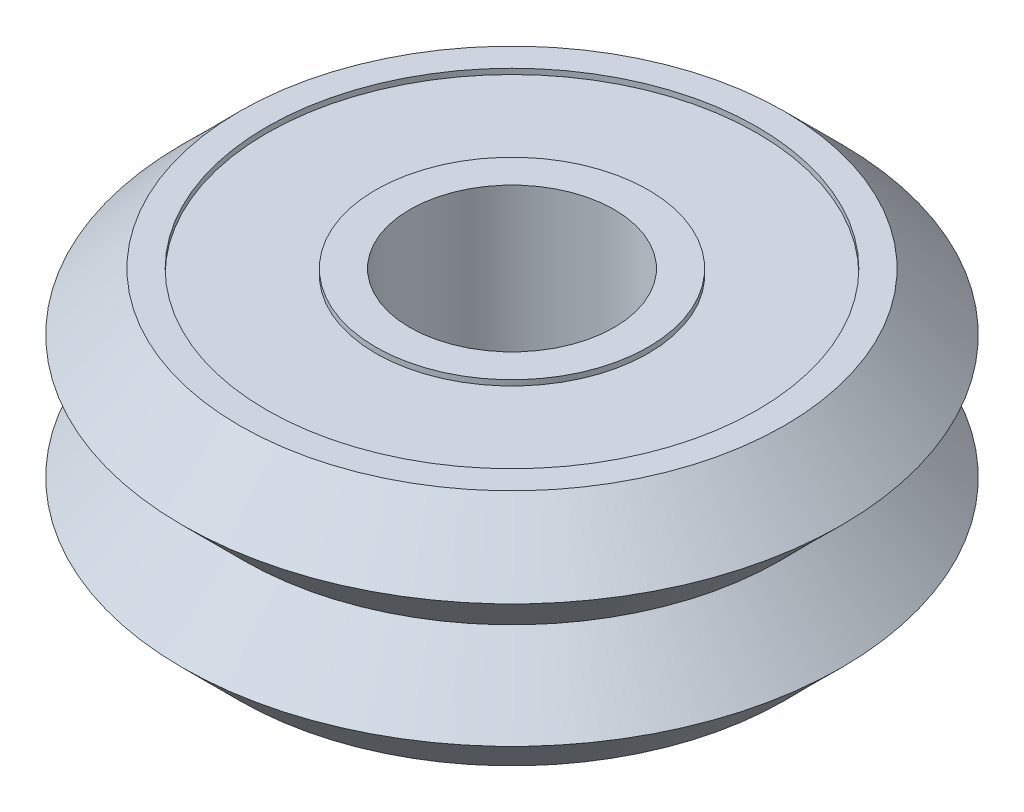
ISO-10303-21;
HEADER;
FILE_DESCRIPTION(('STEP AP214'),'2;1');
FILE_NAME('part.step','',(''),(''),'','','');
FILE_SCHEMA(('AUTOMOTIVE_DESIGN { 1 0 10303 214 1 1 1 1 }'));
ENDSEC;
DATA;
#1=APPLICATION_CONTEXT('core data for automotive mechanical design processes');
#2=APPLICATION_PROTOCOL_DEFINITION('international standard','automotive_design',2000,#1);
#3=PRODUCT_CONTEXT('',#1,'mechanical');
#4=PRODUCT('Part','Part','',(#3));
#5=PRODUCT_RELATED_PRODUCT_CATEGORY('part','',(#4));
#6=PRODUCT_DEFINITION_FORMATION('','',#4);
#7=PRODUCT_DEFINITION_CONTEXT('part definition',#1,'design');
#8=PRODUCT_DEFINITION('design','',#6,#7);
#9=PRODUCT_DEFINITION_SHAPE('','',#8);
#10=(LENGTH_UNIT() NAMED_UNIT(*) SI_UNIT(.MILLI.,.METRE.));
#11=(NAMED_UNIT(*) PLANE_ANGLE_UNIT() SI_UNIT($,.RADIAN.));
#12=(NAMED_UNIT(*) SI_UNIT($,.STERADIAN.) SOLID_ANGLE_UNIT());
#13=UNCERTAINTY_MEASURE_WITH_UNIT(LENGTH_MEASURE(1.E-05),#10,'distance_accuracy_value','');
#14=(GEOMETRIC_REPRESENTATION_CONTEXT(3) GLOBAL_UNCERTAINTY_ASSIGNED_CONTEXT((#13)) GLOBAL_UNIT_ASSIGNED_CONTEXT((#10,
#11,#12)) REPRESENTATION_CONTEXT('',''));
#15=CARTESIAN_POINT('',(0.,0.,0.));
#16=DIRECTION('',(0.,0.,1.));
#17=DIRECTION('',(1.,0.,0.));
#18=AXIS2_PLACEMENT_3D('',#15,#16,#17);
#19=CARTESIAN_POINT('',(4.7625,5.55,0.));
#20=DIRECTION('',(0.,-1.,0.));
#21=DIRECTION('',(0.,0.,-1.));
#22=AXIS2_PLACEMENT_3D('',#19,#20,#21);
#23=PLANE('',#22);
#24=CARTESIAN_POINT('',(0.,5.55,0.));
#25=DIRECTION('',(0.,-1.,0.));
#26=DIRECTION('',(0.,0.,-1.));
#27=AXIS2_PLACEMENT_3D('',#24,#25,#26);
#28=CIRCLE('',#27,12.69);
#29=CARTESIAN_POINT('',(0.,5.55,-12.69));
#30=VERTEX_POINT('',#29);
#31=EDGE_CURVE('E69',#30,#30,#28,.T.);
#32=ORIENTED_EDGE('',*,*,#31,.F.);
#33=EDGE_LOOP('',(#32));
#34=FACE_BOUND('',#33,.T.);
#35=CARTESIAN_POINT('',(0.,5.55,0.));
#36=DIRECTION('',(0.,1.,0.));
#37=DIRECTION('',(0.,0.,1.));
#38=AXIS2_PLACEMENT_3D('',#35,#36,#37);
#39=CIRCLE('',#38,11.43);
#40=CARTESIAN_POINT('',(0.,5.55,11.43));
#41=VERTEX_POINT('',#40);
#42=EDGE_CURVE('E19',#41,#41,#39,.F.);
#43=ORIENTED_EDGE('',*,*,#42,.T.);
#44=EDGE_LOOP('',(#43));
#45=FACE_BOUND('',#44,.T.);
#46=ADVANCED_FACE('F16',(#34,#45),#23,.F.);
#47=CARTESIAN_POINT('',(0.,5.296,0.));
#48=DIRECTION('',(0.,1.,0.));
#49=DIRECTION('',(0.,0.,1.));
#50=AXIS2_PLACEMENT_3D('',#47,#48,#49);
#51=CYLINDRICAL_SURFACE('',#50,11.43);
#52=ORIENTED_EDGE('',*,*,#42,.F.);
#53=EDGE_LOOP('',(#52));
#54=FACE_BOUND('',#53,.T.);
#55=CARTESIAN_POINT('',(0.,5.296,0.));
#56=DIRECTION('',(0.,1.,0.));
#57=DIRECTION('',(0.,0.,1.));
#58=AXIS2_PLACEMENT_3D('',#55,#56,#57);
#59=CIRCLE('',#58,11.43);
#60=CARTESIAN_POINT('',(0.,5.296,11.43));
#61=VERTEX_POINT('',#60);
#62=EDGE_CURVE('E66',#61,#61,#59,.T.);
#63=ORIENTED_EDGE('',*,*,#62,.F.);
#64=EDGE_LOOP('',(#63));
#65=FACE_BOUND('',#64,.T.);
#66=ADVANCED_FACE('F80',(#54,#65),#51,.F.);
#67=CARTESIAN_POINT('',(0.,2.875,0.));
#68=DIRECTION('',(0.,-1.,0.));
#69=DIRECTION('',(0.,0.,-1.));
#70=AXIS2_PLACEMENT_3D('',#67,#68,#69);
#71=CONICAL_SURFACE('',#70,15.365,0.785398163397449);
#72=CARTESIAN_POINT('',(0.,2.875,0.));
#73=DIRECTION('',(0.,1.,0.));
#74=DIRECTION('',(0.,0.,1.));
#75=AXIS2_PLACEMENT_3D('',#72,#73,#74);
#76=CIRCLE('',#75,15.365);
#77=CARTESIAN_POINT('',(0.,2.875,15.365));
#78=VERTEX_POINT('',#77);
#79=EDGE_CURVE('E36',#78,#78,#76,.F.);
#80=ORIENTED_EDGE('',*,*,#79,.F.);
#81=EDGE_LOOP('',(#80));
#82=FACE_BOUND('',#81,.T.);
#83=ORIENTED_EDGE('',*,*,#31,.T.);
#84=EDGE_LOOP('',(#83));
#85=FACE_BOUND('',#84,.T.);
#86=ADVANCED_FACE('F83',(#82,#85),#71,.T.);
#87=CARTESIAN_POINT('',(0.,5.296,0.));
#88=DIRECTION('',(0.,1.,0.));
#89=DIRECTION('',(0.,0.,1.));
#90=AXIS2_PLACEMENT_3D('',#87,#88,#89);
#91=PLANE('',#90);
#92=ORIENTED_EDGE('',*,*,#62,.T.);
#93=EDGE_LOOP('',(#92));
#94=FACE_BOUND('',#93,.T.);
#95=CARTESIAN_POINT('',(0.,5.296,0.));
#96=DIRECTION('',(0.,1.,0.));
#97=DIRECTION('',(0.,0.,1.));
#98=AXIS2_PLACEMENT_3D('',#95,#96,#97);
#99=CIRCLE('',#98,6.35);
#100=CARTESIAN_POINT('',(0.,5.296,6.35));
#101=VERTEX_POINT('',#100);
#102=EDGE_CURVE('E62',#101,#101,#99,.T.);
#103=ORIENTED_EDGE('',*,*,#102,.F.);
#104=EDGE_LOOP('',(#103));
#105=FACE_BOUND('',#104,.T.);
#106=ADVANCED_FACE('F86',(#94,#105),#91,.T.);
#107=CARTESIAN_POINT('',(0.,2.875,0.));
#108=DIRECTION('',(0.,1.,0.));
#109=DIRECTION('',(-1.,0.,0.));
#110=AXIS2_PLACEMENT_3D('',#107,#108,#109);
#111=CONICAL_SURFACE('',#110,15.365,0.785398163397448);
#112=ORIENTED_EDGE('',*,*,#79,.T.);
#113=EDGE_LOOP('',(#112));
#114=FACE_BOUND('',#113,.T.);
#115=CARTESIAN_POINT('',(0.,0.,0.));
#116=DIRECTION('',(0.,-1.,0.));
#117=DIRECTION('',(0.,0.,-1.));
#118=AXIS2_PLACEMENT_3D('',#115,#116,#117);
#119=CIRCLE('',#118,12.49);
#120=CARTESIAN_POINT('',(0.,0.,-12.49));
#121=VERTEX_POINT('',#120);
#122=EDGE_CURVE('E61',#121,#121,#119,.T.);
#123=ORIENTED_EDGE('',*,*,#122,.F.);
#124=EDGE_LOOP('',(#123));
#125=FACE_BOUND('',#124,.T.);
#126=ADVANCED_FACE('F89',(#114,#125),#111,.T.);
#127=CARTESIAN_POINT('',(0.,5.296,0.));
#128=DIRECTION('',(0.,1.,0.));
#129=DIRECTION('',(0.,0.,1.));
#130=AXIS2_PLACEMENT_3D('',#127,#128,#129);
#131=CYLINDRICAL_SURFACE('',#130,6.35);
#132=CARTESIAN_POINT('',(0.,5.55,0.));
#133=DIRECTION('',(0.,1.,0.));
#134=DIRECTION('',(0.,0.,1.));
#135=AXIS2_PLACEMENT_3D('',#132,#133,#134);
#136=CIRCLE('',#135,6.35);
#137=CARTESIAN_POINT('',(0.,5.55,6.35));
#138=VERTEX_POINT('',#137);
#139=EDGE_CURVE('E57',#138,#138,#136,.F.);
#140=ORIENTED_EDGE('',*,*,#139,.T.);
#141=EDGE_LOOP('',(#140));
#142=FACE_BOUND('',#141,.T.);
#143=ORIENTED_EDGE('',*,*,#102,.T.);
#144=EDGE_LOOP('',(#143));
#145=FACE_BOUND('',#144,.T.);
#146=ADVANCED_FACE('F93',(#142,#145),#131,.T.);
#147=CARTESIAN_POINT('',(0.,-2.875,0.));
#148=DIRECTION('',(0.,-1.,0.));
#149=DIRECTION('',(1.,0.,0.));
#150=AXIS2_PLACEMENT_3D('',#147,#148,#149);
#151=CONICAL_SURFACE('',#150,15.365,0.785398163397448);
#152=CARTESIAN_POINT('',(0.,-2.875,0.));
#153=DIRECTION('',(0.,1.,0.));
#154=DIRECTION('',(0.,0.,1.));
#155=AXIS2_PLACEMENT_3D('',#152,#153,#154);
#156=CIRCLE('',#155,15.365);
#157=CARTESIAN_POINT('',(0.,-2.875,15.365));
#158=VERTEX_POINT('',#157);
#159=EDGE_CURVE('E56',#158,#158,#156,.F.);
#160=ORIENTED_EDGE('',*,*,#159,.F.);
#161=EDGE_LOOP('',(#160));
#162=FACE_BOUND('',#161,.T.);
#163=ORIENTED_EDGE('',*,*,#122,.T.);
#164=EDGE_LOOP('',(#163));
#165=FACE_BOUND('',#164,.T.);
#166=ADVANCED_FACE('F95',(#162,#165),#151,.T.);
#167=CARTESIAN_POINT('',(4.7625,5.55,0.));
#168=DIRECTION('',(0.,-1.,0.));
#169=DIRECTION('',(0.,0.,-1.));
#170=AXIS2_PLACEMENT_3D('',#167,#168,#169);
#171=PLANE('',#170);
#172=ORIENTED_EDGE('',*,*,#139,.F.);
#173=EDGE_LOOP('',(#172));
#174=FACE_BOUND('',#173,.T.);
#175=CARTESIAN_POINT('',(0.,5.55,0.));
#176=DIRECTION('',(0.,1.,0.));
#177=DIRECTION('',(0.,0.,1.));
#178=AXIS2_PLACEMENT_3D('',#175,#176,#177);
#179=CIRCLE('',#178,4.7625);
#180=CARTESIAN_POINT('',(0.,5.55,4.7625));
#181=VERTEX_POINT('',#180);
#182=EDGE_CURVE('E52',#181,#181,#179,.F.);
#183=ORIENTED_EDGE('',*,*,#182,.T.);
#184=EDGE_LOOP('',(#183));
#185=FACE_BOUND('',#184,.T.);
#186=ADVANCED_FACE('F103',(#174,#185),#171,.F.);
#187=CARTESIAN_POINT('',(0.,-2.875,0.));
#188=DIRECTION('',(0.,1.,0.));
#189=DIRECTION('',(0.,0.,1.));
#190=AXIS2_PLACEMENT_3D('',#187,#188,#189);
#191=CONICAL_SURFACE('',#190,15.365,0.785398163397449);
#192=ORIENTED_EDGE('',*,*,#159,.T.);
#193=EDGE_LOOP('',(#192));
#194=FACE_BOUND('',#193,.T.);
#195=CARTESIAN_POINT('',(0.,-5.55,0.));
#196=DIRECTION('',(0.,1.,0.));
#197=DIRECTION('',(0.,0.,1.));
#198=AXIS2_PLACEMENT_3D('',#195,#196,#197);
#199=CIRCLE('',#198,12.69);
#200=CARTESIAN_POINT('',(0.,-5.55,12.69));
#201=VERTEX_POINT('',#200);
#202=EDGE_CURVE('E48',#201,#201,#199,.T.);
#203=ORIENTED_EDGE('',*,*,#202,.T.);
#204=EDGE_LOOP('',(#203));
#205=FACE_BOUND('',#204,.T.);
#206=ADVANCED_FACE('F134',(#194,#205),#191,.T.);
#207=CARTESIAN_POINT('',(0.,64.3897959183673,0.));
#208=DIRECTION('',(0.,1.,0.));
#209=DIRECTION('',(0.,0.,1.));
#210=AXIS2_PLACEMENT_3D('',#207,#208,#209);
#211=CYLINDRICAL_SURFACE('',#210,4.7625);
#212=CARTESIAN_POINT('',(0.,-5.55,0.));
#213=DIRECTION('',(0.,1.,0.));
#214=DIRECTION('',(0.,0.,1.));
#215=AXIS2_PLACEMENT_3D('',#212,#213,#214);
#216=CIRCLE('',#215,4.7625);
#217=CARTESIAN_POINT('',(0.,-5.55,4.7625));
#218=VERTEX_POINT('',#217);
#219=EDGE_CURVE('E45',#218,#218,#216,.F.);
#220=ORIENTED_EDGE('',*,*,#219,.T.);
#221=EDGE_LOOP('',(#220));
#222=FACE_BOUND('',#221,.T.);
#223=ORIENTED_EDGE('',*,*,#182,.F.);
#224=EDGE_LOOP('',(#223));
#225=FACE_BOUND('',#224,.T.);
#226=ADVANCED_FACE('F130',(#222,#225),#211,.F.);
#227=CARTESIAN_POINT('',(12.69,-5.55,0.));
#228=DIRECTION('',(0.,1.,0.));
#229=DIRECTION('',(0.,0.,1.));
#230=AXIS2_PLACEMENT_3D('',#227,#228,#229);
#231=PLANE('',#230);
#232=CARTESIAN_POINT('',(0.,-5.55,0.));
#233=DIRECTION('',(0.,-1.,0.));
#234=DIRECTION('',(0.,0.,-1.));
#235=AXIS2_PLACEMENT_3D('',#232,#233,#234);
#236=CIRCLE('',#235,11.43);
#237=CARTESIAN_POINT('',(0.,-5.55,-11.43));
#238=VERTEX_POINT('',#237);
#239=EDGE_CURVE('E41',#238,#238,#236,.F.);
#240=ORIENTED_EDGE('',*,*,#239,.T.);
#241=EDGE_LOOP('',(#240));
#242=FACE_BOUND('',#241,.T.);
#243=ORIENTED_EDGE('',*,*,#202,.F.);
#244=EDGE_LOOP('',(#243));
#245=FACE_BOUND('',#244,.T.);
#246=ADVANCED_FACE('F126',(#242,#245),#231,.F.);
#247=CARTESIAN_POINT('',(12.69,-5.55,0.));
#248=DIRECTION('',(0.,1.,0.));
#249=DIRECTION('',(0.,0.,1.));
#250=AXIS2_PLACEMENT_3D('',#247,#248,#249);
#251=PLANE('',#250);
#252=ORIENTED_EDGE('',*,*,#219,.F.);
#253=EDGE_LOOP('',(#252));
#254=FACE_BOUND('',#253,.T.);
#255=CARTESIAN_POINT('',(0.,-5.55,0.));
#256=DIRECTION('',(0.,-1.,0.));
#257=DIRECTION('',(0.,0.,-1.));
#258=AXIS2_PLACEMENT_3D('',#255,#256,#257);
#259=CIRCLE('',#258,6.35);
#260=CARTESIAN_POINT('',(0.,-5.55,-6.35));
#261=VERTEX_POINT('',#260);
#262=EDGE_CURVE('E33',#261,#261,#259,.F.);
#263=ORIENTED_EDGE('',*,*,#262,.F.);
#264=EDGE_LOOP('',(#263));
#265=FACE_BOUND('',#264,.T.);
#266=ADVANCED_FACE('F122',(#254,#265),#251,.F.);
#267=CARTESIAN_POINT('',(0.,-5.296,0.));
#268=DIRECTION('',(0.,-1.,0.));
#269=DIRECTION('',(0.,0.,-1.));
#270=AXIS2_PLACEMENT_3D('',#267,#268,#269);
#271=CYLINDRICAL_SURFACE('',#270,11.43);
#272=CARTESIAN_POINT('',(0.,-5.296,0.));
#273=DIRECTION('',(0.,-1.,0.));
#274=DIRECTION('',(0.,0.,-1.));
#275=AXIS2_PLACEMENT_3D('',#272,#273,#274);
#276=CIRCLE('',#275,11.43);
#277=CARTESIAN_POINT('',(0.,-5.296,-11.43));
#278=VERTEX_POINT('',#277);
#279=EDGE_CURVE('E24',#278,#278,#276,.T.);
#280=ORIENTED_EDGE('',*,*,#279,.F.);
#281=EDGE_LOOP('',(#280));
#282=FACE_BOUND('',#281,.T.);
#283=ORIENTED_EDGE('',*,*,#239,.F.);
#284=EDGE_LOOP('',(#283));
#285=FACE_BOUND('',#284,.T.);
#286=ADVANCED_FACE('F115',(#282,#285),#271,.F.);
#287=CARTESIAN_POINT('',(0.,-5.296,0.));
#288=DIRECTION('',(0.,-1.,0.));
#289=DIRECTION('',(0.,0.,-1.));
#290=AXIS2_PLACEMENT_3D('',#287,#288,#289);
#291=CYLINDRICAL_SURFACE('',#290,6.35);
#292=ORIENTED_EDGE('',*,*,#262,.T.);
#293=EDGE_LOOP('',(#292));
#294=FACE_BOUND('',#293,.T.);
#295=CARTESIAN_POINT('',(0.,-5.296,0.));
#296=DIRECTION('',(0.,-1.,0.));
#297=DIRECTION('',(0.,0.,-1.));
#298=AXIS2_PLACEMENT_3D('',#295,#296,#297);
#299=CIRCLE('',#298,6.35);
#300=CARTESIAN_POINT('',(0.,-5.296,-6.35));
#301=VERTEX_POINT('',#300);
#302=EDGE_CURVE('E10',#301,#301,#299,.F.);
#303=ORIENTED_EDGE('',*,*,#302,.F.);
#304=EDGE_LOOP('',(#303));
#305=FACE_BOUND('',#304,.T.);
#306=ADVANCED_FACE('F110',(#294,#305),#291,.T.);
#307=CARTESIAN_POINT('',(0.,-5.296,0.));
#308=DIRECTION('',(0.,-1.,0.));
#309=DIRECTION('',(0.,0.,-1.));
#310=AXIS2_PLACEMENT_3D('',#307,#308,#309);
#311=PLANE('',#310);
#312=ORIENTED_EDGE('',*,*,#302,.T.);
#313=EDGE_LOOP('',(#312));
#314=FACE_BOUND('',#313,.T.);
#315=ORIENTED_EDGE('',*,*,#279,.T.);
#316=EDGE_LOOP('',(#315));
#317=FACE_BOUND('',#316,.T.);
#318=ADVANCED_FACE('F108',(#314,#317),#311,.T.);
#319=CLOSED_SHELL('',(#46,#66,#86,#106,#126,#146,#166,#186,#206,#226,#246,#266,#286,#306,#318));
#320=MANIFOLD_SOLID_BREP('B1',#319);
#321=ADVANCED_BREP_SHAPE_REPRESENTATION('',(#18,#320),#14);
#322=SHAPE_DEFINITION_REPRESENTATION(#9,#321);
ENDSEC;
END-ISO-10303-21;
